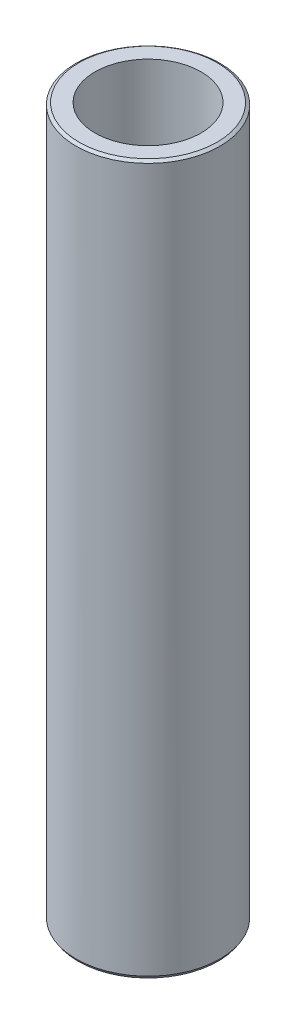
ISO-10303-21;
HEADER;
FILE_DESCRIPTION(('STEP AP214'),'2;1');
FILE_NAME('part.step','',(''),(''),'','','');
FILE_SCHEMA(('AUTOMOTIVE_DESIGN { 1 0 10303 214 1 1 1 1 }'));
ENDSEC;
DATA;
#1=APPLICATION_CONTEXT('core data for automotive mechanical design processes');
#2=APPLICATION_PROTOCOL_DEFINITION('international standard','automotive_design',2000,#1);
#3=PRODUCT_CONTEXT('',#1,'mechanical');
#4=PRODUCT('Part','Part','',(#3));
#5=PRODUCT_RELATED_PRODUCT_CATEGORY('part','',(#4));
#6=PRODUCT_DEFINITION_FORMATION('','',#4);
#7=PRODUCT_DEFINITION_CONTEXT('part definition',#1,'design');
#8=PRODUCT_DEFINITION('design','',#6,#7);
#9=PRODUCT_DEFINITION_SHAPE('','',#8);
#10=(LENGTH_UNIT() NAMED_UNIT(*) SI_UNIT(.MILLI.,.METRE.));
#11=(NAMED_UNIT(*) PLANE_ANGLE_UNIT() SI_UNIT($,.RADIAN.));
#12=(NAMED_UNIT(*) SI_UNIT($,.STERADIAN.) SOLID_ANGLE_UNIT());
#13=UNCERTAINTY_MEASURE_WITH_UNIT(LENGTH_MEASURE(1.E-05),#10,'distance_accuracy_value','');
#14=(GEOMETRIC_REPRESENTATION_CONTEXT(3) GLOBAL_UNCERTAINTY_ASSIGNED_CONTEXT((#13)) GLOBAL_UNIT_ASSIGNED_CONTEXT((#10,
#11,#12)) REPRESENTATION_CONTEXT('',''));
#15=CARTESIAN_POINT('',(0.,0.,0.));
#16=DIRECTION('',(0.,0.,1.));
#17=DIRECTION('',(1.,0.,0.));
#18=AXIS2_PLACEMENT_3D('',#15,#16,#17);
#19=CARTESIAN_POINT('',(0.,541.920394490648,0.));
#20=DIRECTION('',(0.,-1.,0.));
#21=DIRECTION('',(0.,0.,-1.));
#22=AXIS2_PLACEMENT_3D('',#19,#20,#21);
#23=CYLINDRICAL_SURFACE('',#22,55.);
#24=CARTESIAN_POINT('',(0.,540.425215934427,0.));
#25=DIRECTION('',(0.,1.,0.));
#26=DIRECTION('',(0.,0.,1.));
#27=AXIS2_PLACEMENT_3D('',#24,#25,#26);
#28=CIRCLE('',#27,55.);
#29=CARTESIAN_POINT('',(0.,540.425215934427,-55.));
#30=VERTEX_POINT('',#29);
#31=EDGE_CURVE('E50',#30,#30,#28,.F.);
#32=CARTESIAN_POINT('',(0.,2.2728483977611,0.));
#33=DIRECTION('',(0.,1.,0.));
#34=DIRECTION('',(0.,0.,1.));
#35=AXIS2_PLACEMENT_3D('',#32,#33,#34);
#36=CIRCLE('',#35,55.);
#37=CARTESIAN_POINT('',(0.,2.27284839776098,-55.));
#38=VERTEX_POINT('',#37);
#39=EDGE_CURVE('E51',#38,#38,#36,.T.);
#40=CARTESIAN_POINT('',(0.,540.425215934427,-55.));
#41=CARTESIAN_POINT('',(0.,534.81946210592,-55.));
#42=CARTESIAN_POINT('',(0.,529.213708277413,-55.));
#43=CARTESIAN_POINT('',(0.,518.002200620399,-55.));
#44=CARTESIAN_POINT('',(0.,512.396446791892,-55.));
#45=CARTESIAN_POINT('',(0.,501.184939134879,-55.));
#46=CARTESIAN_POINT('',(0.,495.579185306372,-55.));
#47=CARTESIAN_POINT('',(0.,484.367677649358,-55.));
#48=CARTESIAN_POINT('',(0.,478.761923820851,-55.));
#49=CARTESIAN_POINT('',(0.,467.550416163837,-55.));
#50=CARTESIAN_POINT('',(0.,461.94466233533,-55.));
#51=CARTESIAN_POINT('',(0.,450.733154678316,-55.));
#52=CARTESIAN_POINT('',(0.,445.127400849809,-55.));
#53=CARTESIAN_POINT('',(0.,433.915893192795,-55.));
#54=CARTESIAN_POINT('',(0.,428.310139364288,-55.));
#55=CARTESIAN_POINT('',(0.,417.098631707275,-55.));
#56=CARTESIAN_POINT('',(0.,411.492877878768,-55.));
#57=CARTESIAN_POINT('',(0.,400.281370221754,-55.));
#58=CARTESIAN_POINT('',(0.,394.675616393247,-55.));
#59=CARTESIAN_POINT('',(0.,383.464108736233,-55.));
#60=CARTESIAN_POINT('',(0.,377.858354907726,-55.));
#61=CARTESIAN_POINT('',(0.,366.646847250712,-55.));
#62=CARTESIAN_POINT('',(0.,361.041093422205,-55.));
#63=CARTESIAN_POINT('',(0.,349.829585765191,-55.));
#64=CARTESIAN_POINT('',(0.,344.223831936684,-55.));
#65=CARTESIAN_POINT('',(0.,333.01232427967,-55.));
#66=CARTESIAN_POINT('',(0.,327.406570451163,-55.));
#67=CARTESIAN_POINT('',(0.,316.19506279415,-55.));
#68=CARTESIAN_POINT('',(0.,310.589308965643,-55.));
#69=CARTESIAN_POINT('',(0.,299.377801308629,-55.));
#70=CARTESIAN_POINT('',(0.,293.772047480122,-55.));
#71=CARTESIAN_POINT('',(0.,282.560539823108,-55.));
#72=CARTESIAN_POINT('',(0.,276.954785994601,-55.));
#73=CARTESIAN_POINT('',(0.,265.743278337587,-55.));
#74=CARTESIAN_POINT('',(0.,260.13752450908,-55.));
#75=CARTESIAN_POINT('',(0.,248.926016852066,-55.));
#76=CARTESIAN_POINT('',(0.,243.320263023559,-55.));
#77=CARTESIAN_POINT('',(0.,232.108755366545,-55.));
#78=CARTESIAN_POINT('',(0.,226.503001538039,-55.));
#79=CARTESIAN_POINT('',(0.,215.291493881025,-55.));
#80=CARTESIAN_POINT('',(0.,209.685740052518,-55.));
#81=CARTESIAN_POINT('',(0.,198.474232395504,-55.));
#82=CARTESIAN_POINT('',(0.,192.868478566997,-55.));
#83=CARTESIAN_POINT('',(0.,181.656970909983,-55.));
#84=CARTESIAN_POINT('',(0.,176.051217081476,-55.));
#85=CARTESIAN_POINT('',(0.,164.839709424462,-55.));
#86=CARTESIAN_POINT('',(0.,159.233955595955,-55.));
#87=CARTESIAN_POINT('',(0.,148.022447938941,-55.));
#88=CARTESIAN_POINT('',(0.,142.416694110434,-55.));
#89=CARTESIAN_POINT('',(0.,131.205186453421,-55.));
#90=CARTESIAN_POINT('',(0.,125.599432624914,-55.));
#91=CARTESIAN_POINT('',(0.,114.3879249679,-55.));
#92=CARTESIAN_POINT('',(0.,108.782171139393,-55.));
#93=CARTESIAN_POINT('',(0.,97.5706634823789,-55.));
#94=CARTESIAN_POINT('',(0.,91.964909653872,-55.));
#95=CARTESIAN_POINT('',(0.,80.7534019968581,-55.));
#96=CARTESIAN_POINT('',(0.,75.1476481683511,-55.));
#97=CARTESIAN_POINT('',(0.,63.9361405113372,-55.));
#98=CARTESIAN_POINT('',(0.,58.3303866828303,-55.));
#99=CARTESIAN_POINT('',(0.,47.1188790258164,-55.));
#100=CARTESIAN_POINT('',(0.,41.5131251973094,-55.));
#101=CARTESIAN_POINT('',(0.,30.3016175402956,-55.));
#102=CARTESIAN_POINT('',(0.,24.6958637117887,-55.));
#103=CARTESIAN_POINT('',(0.,13.4843560547749,-55.));
#104=CARTESIAN_POINT('',(0.,7.87860222626794,-55.));
#105=CARTESIAN_POINT('',(0.,2.27284839776098,-55.));
#106=B_SPLINE_CURVE_WITH_KNOTS('',3,(#40,#41,#42,#43,#44,#45,#46,#47,#48,#49,#50,#51,#52,#53,
#54,#55,#56,#57,#58,#59,#60,#61,#62,#63,#64,#65,#66,#67,#68,#69,#70,#71,#72,#73,#74,#75,#76,#77,
#78,#79,#80,#81,#82,#83,#84,#85,#86,#87,#88,#89,#90,#91,#92,#93,#94,#95,#96,#97,#98,#99,#100,
#101,#102,#103,#104,#105),.UNSPECIFIED.,.F.,.F.,(4,2,2,2,2,2,2,2,2,2,2,2,2,2,2,2,2,2,2,2,2,2,2,
2,2,2,2,2,2,2,2,2,4),(0.,16.8172614855209,33.6345229710417,50.4517844565625,67.2690459420833,
84.0863074276041,100.903568913125,117.720830398646,134.538091884167,151.355353369687,
168.172614855208,184.989876340729,201.80713782625,218.624399311771,235.441660797292,
252.258922282812,269.076183768333,285.893445253854,302.710706739375,319.527968224896,
336.345229710416,353.162491195937,369.979752681458,386.797014166979,403.6142756525,
420.431537138021,437.248798623541,454.066060109062,470.883321594583,487.700583080104,
504.517844565625,521.335106051145,538.152367536666),.UNSPECIFIED.);
#107=EDGE_CURVE('BSEAM39',#30,#38,#106,.T.);
#108=ORIENTED_EDGE('',*,*,#31,.T.);
#109=ORIENTED_EDGE('',*,*,#39,.T.);
#110=ORIENTED_EDGE('',*,*,#107,.T.);
#111=ORIENTED_EDGE('',*,*,#107,.F.);
#112=EDGE_LOOP('',(#108,#110,#109,#111));
#113=FACE_BOUND('',#112,.T.);
#114=ADVANCED_FACE('F39',(#113),#23,.T.);
#115=CARTESIAN_POINT('',(0.,541.920394490648,0.));
#116=DIRECTION('',(0.,1.,0.));
#117=DIRECTION('',(0.,0.,1.));
#118=AXIS2_PLACEMENT_3D('',#115,#116,#117);
#119=PLANE('',#118);
#120=CARTESIAN_POINT('',(0.,541.920394490648,0.));
#121=DIRECTION('',(0.,1.,0.));
#122=DIRECTION('',(0.,0.,1.));
#123=AXIS2_PLACEMENT_3D('',#120,#121,#122);
#124=CIRCLE('',#123,52.7271516022399);
#125=CARTESIAN_POINT('',(0.,541.920394490648,52.7271516022399));
#126=VERTEX_POINT('',#125);
#127=EDGE_CURVE('E54',#126,#126,#124,.T.);
#128=ORIENTED_EDGE('',*,*,#127,.T.);
#129=EDGE_LOOP('',(#128));
#130=FACE_BOUND('',#129,.T.);
#131=CARTESIAN_POINT('',(0.,541.920394490648,0.));
#132=DIRECTION('',(0.,1.,0.));
#133=DIRECTION('',(0.,0.,1.));
#134=AXIS2_PLACEMENT_3D('',#131,#132,#133);
#135=CIRCLE('',#134,40.5512721950302);
#136=CARTESIAN_POINT('',(0.,541.920394490648,-40.5512721950302));
#137=VERTEX_POINT('',#136);
#138=EDGE_CURVE('E58',#137,#137,#135,.T.);
#139=ORIENTED_EDGE('',*,*,#138,.F.);
#140=EDGE_LOOP('',(#139));
#141=FACE_BOUND('',#140,.T.);
#142=ADVANCED_FACE('F69',(#130,#141),#119,.T.);
#143=CARTESIAN_POINT('',(0.,0.,0.));
#144=DIRECTION('',(0.,1.,0.));
#145=DIRECTION('',(0.,0.,1.));
#146=AXIS2_PLACEMENT_3D('',#143,#144,#145);
#147=PLANE('',#146);
#148=CARTESIAN_POINT('',(0.,0.,0.));
#149=DIRECTION('',(0.,1.,0.));
#150=DIRECTION('',(0.,0.,1.));
#151=AXIS2_PLACEMENT_3D('',#148,#149,#150);
#152=CIRCLE('',#151,53.5048214437782);
#153=CARTESIAN_POINT('',(0.,0.,53.5048214437782));
#154=VERTEX_POINT('',#153);
#155=EDGE_CURVE('E10',#154,#154,#152,.F.);
#156=ORIENTED_EDGE('',*,*,#155,.T.);
#157=EDGE_LOOP('',(#156));
#158=FACE_BOUND('',#157,.T.);
#159=CARTESIAN_POINT('',(0.,0.,0.));
#160=DIRECTION('',(0.,1.,0.));
#161=DIRECTION('',(0.,0.,1.));
#162=AXIS2_PLACEMENT_3D('',#159,#160,#161);
#163=CIRCLE('',#162,40.5512721950302);
#164=CARTESIAN_POINT('',(0.,0.,-40.5512721950302));
#165=VERTEX_POINT('',#164);
#166=EDGE_CURVE('E63',#165,#165,#163,.T.);
#167=ORIENTED_EDGE('',*,*,#166,.T.);
#168=EDGE_LOOP('',(#167));
#169=FACE_BOUND('',#168,.T.);
#170=ADVANCED_FACE('F75',(#158,#169),#147,.F.);
#171=CARTESIAN_POINT('',(0.,541.920394490648,0.));
#172=DIRECTION('',(0.,-1.,0.));
#173=DIRECTION('',(0.,0.,-1.));
#174=AXIS2_PLACEMENT_3D('',#171,#172,#173);
#175=CYLINDRICAL_SURFACE('',#174,40.5512721950302);
#176=CARTESIAN_POINT('',(0.,541.920394490648,-40.5512721950302));
#177=CARTESIAN_POINT('',(0.,536.275390381371,-40.5512721950302));
#178=CARTESIAN_POINT('',(0.,530.630386272093,-40.5512721950302));
#179=CARTESIAN_POINT('',(0.,519.340378053538,-40.5512721950302));
#180=CARTESIAN_POINT('',(0.,513.69537394426,-40.5512721950302));
#181=CARTESIAN_POINT('',(0.,502.405365725705,-40.5512721950302));
#182=CARTESIAN_POINT('',(0.,496.760361616428,-40.5512721950302));
#183=CARTESIAN_POINT('',(0.,485.470353397872,-40.5512721950302));
#184=CARTESIAN_POINT('',(0.,479.825349288595,-40.5512721950302));
#185=CARTESIAN_POINT('',(0.,468.53534107004,-40.5512721950302));
#186=CARTESIAN_POINT('',(0.,462.890336960762,-40.5512721950302));
#187=CARTESIAN_POINT('',(0.,451.600328742207,-40.5512721950302));
#188=CARTESIAN_POINT('',(0.,445.955324632929,-40.5512721950302));
#189=CARTESIAN_POINT('',(0.,434.665316414374,-40.5512721950302));
#190=CARTESIAN_POINT('',(0.,429.020312305097,-40.5512721950302));
#191=CARTESIAN_POINT('',(0.,417.730304086541,-40.5512721950302));
#192=CARTESIAN_POINT('',(0.,412.085299977264,-40.5512721950302));
#193=CARTESIAN_POINT('',(0.,400.795291758709,-40.5512721950302));
#194=CARTESIAN_POINT('',(0.,395.150287649431,-40.5512721950302));
#195=CARTESIAN_POINT('',(0.,383.860279430876,-40.5512721950302));
#196=CARTESIAN_POINT('',(0.,378.215275321598,-40.5512721950302));
#197=CARTESIAN_POINT('',(0.,366.925267103043,-40.5512721950302));
#198=CARTESIAN_POINT('',(0.,361.280262993766,-40.5512721950302));
#199=CARTESIAN_POINT('',(0.,349.99025477521,-40.5512721950302));
#200=CARTESIAN_POINT('',(0.,344.345250665933,-40.5512721950302));
#201=CARTESIAN_POINT('',(0.,333.055242447378,-40.5512721950302));
#202=CARTESIAN_POINT('',(0.,327.4102383381,-40.5512721950302));
#203=CARTESIAN_POINT('',(0.,316.120230119545,-40.5512721950302));
#204=CARTESIAN_POINT('',(0.,310.475226010267,-40.5512721950302));
#205=CARTESIAN_POINT('',(0.,299.185217791712,-40.5512721950302));
#206=CARTESIAN_POINT('',(0.,293.540213682435,-40.5512721950302));
#207=CARTESIAN_POINT('',(0.,282.250205463879,-40.5512721950302));
#208=CARTESIAN_POINT('',(0.,276.605201354602,-40.5512721950302));
#209=CARTESIAN_POINT('',(0.,265.315193136047,-40.5512721950302));
#210=CARTESIAN_POINT('',(0.,259.670189026769,-40.5512721950302));
#211=CARTESIAN_POINT('',(0.,248.380180808214,-40.5512721950302));
#212=CARTESIAN_POINT('',(0.,242.735176698936,-40.5512721950302));
#213=CARTESIAN_POINT('',(0.,231.445168480381,-40.5512721950302));
#214=CARTESIAN_POINT('',(0.,225.800164371104,-40.5512721950302));
#215=CARTESIAN_POINT('',(0.,214.510156152548,-40.5512721950302));
#216=CARTESIAN_POINT('',(0.,208.865152043271,-40.5512721950302));
#217=CARTESIAN_POINT('',(0.,197.575143824716,-40.5512721950302));
#218=CARTESIAN_POINT('',(0.,191.930139715438,-40.5512721950302));
#219=CARTESIAN_POINT('',(0.,180.640131496883,-40.5512721950302));
#220=CARTESIAN_POINT('',(0.,174.995127387605,-40.5512721950302));
#221=CARTESIAN_POINT('',(0.,163.70511916905,-40.5512721950302));
#222=CARTESIAN_POINT('',(0.,158.060115059772,-40.5512721950302));
#223=CARTESIAN_POINT('',(0.,146.770106841217,-40.5512721950302));
#224=CARTESIAN_POINT('',(0.,141.12510273194,-40.5512721950302));
#225=CARTESIAN_POINT('',(0.,129.835094513385,-40.5512721950302));
#226=CARTESIAN_POINT('',(0.,124.190090404107,-40.5512721950302));
#227=CARTESIAN_POINT('',(0.,112.900082185552,-40.5512721950302));
#228=CARTESIAN_POINT('',(0.,107.255078076274,-40.5512721950302));
#229=CARTESIAN_POINT('',(0.,95.965069857719,-40.5512721950302));
#230=CARTESIAN_POINT('',(0.,90.3200657484414,-40.5512721950302));
#231=CARTESIAN_POINT('',(0.,79.0300575298862,-40.5512721950302));
#232=CARTESIAN_POINT('',(0.,73.3850534206086,-40.5512721950302));
#233=CARTESIAN_POINT('',(0.,62.0950452020535,-40.5512721950302));
#234=CARTESIAN_POINT('',(0.,56.4500410927759,-40.5512721950302));
#235=CARTESIAN_POINT('',(0.,45.1600328742207,-40.5512721950302));
#236=CARTESIAN_POINT('',(0.,39.5150287649432,-40.5512721950302));
#237=CARTESIAN_POINT('',(0.,28.225020546388,-40.5512721950302));
#238=CARTESIAN_POINT('',(0.,22.5800164371104,-40.5512721950302));
#239=CARTESIAN_POINT('',(0.,11.2900082185552,-40.5512721950302));
#240=CARTESIAN_POINT('',(0.,5.64500410927759,-40.5512721950302));
#241=CARTESIAN_POINT('',(0.,0.,-40.5512721950302));
#242=B_SPLINE_CURVE_WITH_KNOTS('',3,(#176,#177,#178,#179,#180,#181,#182,#183,#184,#185,#186,
#187,#188,#189,#190,#191,#192,#193,#194,#195,#196,#197,#198,#199,#200,#201,#202,#203,#204,#205,
#206,#207,#208,#209,#210,#211,#212,#213,#214,#215,#216,#217,#218,#219,#220,#221,#222,#223,#224,
#225,#226,#227,#228,#229,#230,#231,#232,#233,#234,#235,#236,#237,#238,#239,#240,#241),
.UNSPECIFIED.,.F.,.F.,(4,2,2,2,2,2,2,2,2,2,2,2,2,2,2,2,2,2,2,2,2,2,2,2,2,2,2,2,2,2,2,2,4),(0.,
16.9350123278327,33.8700246556655,50.8050369834983,67.740049311331,84.6750616391637,
101.610073966997,118.545086294829,135.480098622662,152.415110950495,169.350123278328,
186.28513560616,203.220147933993,220.155160261826,237.090172589659,254.025184917491,
270.960197245324,287.895209573157,304.83022190099,321.765234228822,338.700246556655,
355.635258884488,372.570271212321,389.505283540153,406.440295867986,423.375308195819,
440.310320523652,457.245332851484,474.180345179317,491.11535750715,508.050369834983,
524.985382162816,541.920394490648),.UNSPECIFIED.);
#243=EDGE_CURVE('BSEAM70',#137,#165,#242,.T.);
#244=ORIENTED_EDGE('',*,*,#138,.T.);
#245=ORIENTED_EDGE('',*,*,#166,.F.);
#246=ORIENTED_EDGE('',*,*,#243,.T.);
#247=ORIENTED_EDGE('',*,*,#243,.F.);
#248=EDGE_LOOP('',(#244,#246,#245,#247));
#249=FACE_BOUND('',#248,.T.);
#250=ADVANCED_FACE('F70',(#249),#175,.F.);
#251=CARTESIAN_POINT('',(0.,541.920394490648,0.));
#252=DIRECTION('',(0.,-1.,0.));
#253=DIRECTION('',(0.,0.,-1.));
#254=AXIS2_PLACEMENT_3D('',#251,#252,#253);
#255=CONICAL_SURFACE('',#254,52.7271516022399,0.988926965339678);
#256=ORIENTED_EDGE('',*,*,#31,.F.);
#257=EDGE_LOOP('',(#256));
#258=FACE_BOUND('',#257,.T.);
#259=ORIENTED_EDGE('',*,*,#127,.F.);
#260=EDGE_LOOP('',(#259));
#261=FACE_BOUND('',#260,.T.);
#262=ADVANCED_FACE('F81',(#258,#261),#255,.T.);
#263=CARTESIAN_POINT('',(0.,2.2728483977611,0.));
#264=DIRECTION('',(0.,1.,0.));
#265=DIRECTION('',(0.,0.,1.));
#266=AXIS2_PLACEMENT_3D('',#263,#264,#265);
#267=CONICAL_SURFACE('',#266,55.,0.581869361455202);
#268=ORIENTED_EDGE('',*,*,#155,.F.);
#269=EDGE_LOOP('',(#268));
#270=FACE_BOUND('',#269,.T.);
#271=ORIENTED_EDGE('',*,*,#39,.F.);
#272=EDGE_LOOP('',(#271));
#273=FACE_BOUND('',#272,.T.);
#274=ADVANCED_FACE('F45',(#270,#273),#267,.T.);
#275=CLOSED_SHELL('',(#114,#142,#170,#250,#262,#274));
#276=MANIFOLD_SOLID_BREP('B2',#275);
#277=ADVANCED_BREP_SHAPE_REPRESENTATION('',(#18,#276),#14);
#278=SHAPE_DEFINITION_REPRESENTATION(#9,#277);
ENDSEC;
END-ISO-10303-21;
